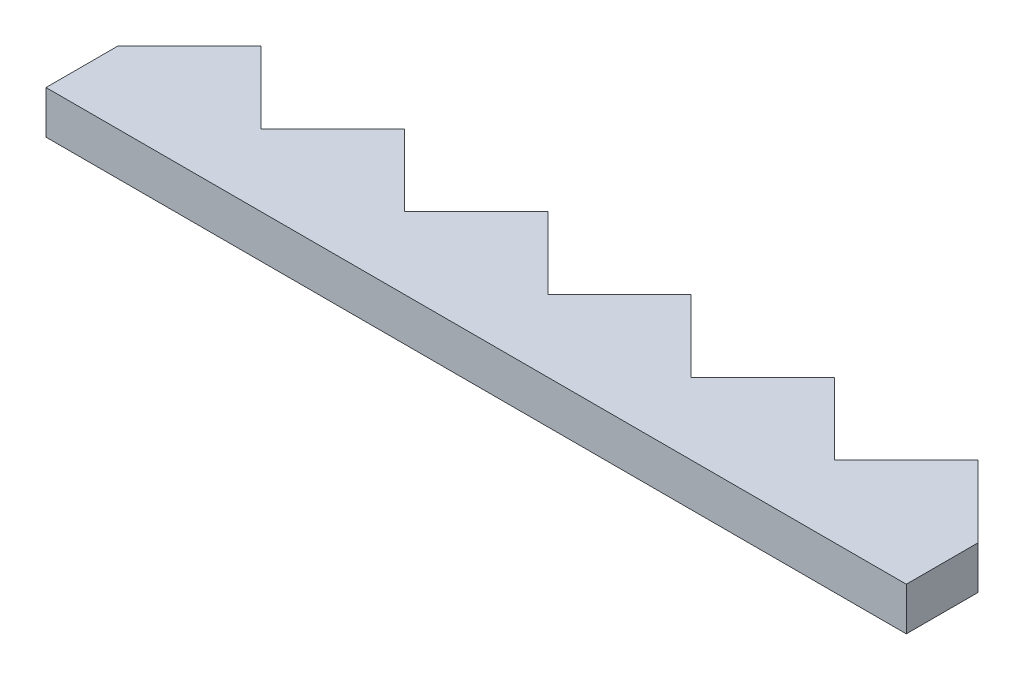
ISO-10303-21;
HEADER;
FILE_DESCRIPTION(('STEP AP214'),'2;1');
FILE_NAME('part.step','',(''),(''),'','','');
FILE_SCHEMA(('AUTOMOTIVE_DESIGN { 1 0 10303 214 1 1 1 1 }'));
ENDSEC;
DATA;
#1=APPLICATION_CONTEXT('core data for automotive mechanical design processes');
#2=APPLICATION_PROTOCOL_DEFINITION('international standard','automotive_design',2000,#1);
#3=PRODUCT_CONTEXT('',#1,'mechanical');
#4=PRODUCT('Part','Part','',(#3));
#5=PRODUCT_RELATED_PRODUCT_CATEGORY('part','',(#4));
#6=PRODUCT_DEFINITION_FORMATION('','',#4);
#7=PRODUCT_DEFINITION_CONTEXT('part definition',#1,'design');
#8=PRODUCT_DEFINITION('design','',#6,#7);
#9=PRODUCT_DEFINITION_SHAPE('','',#8);
#10=(LENGTH_UNIT() NAMED_UNIT(*) SI_UNIT(.MILLI.,.METRE.));
#11=(NAMED_UNIT(*) PLANE_ANGLE_UNIT() SI_UNIT($,.RADIAN.));
#12=(NAMED_UNIT(*) SI_UNIT($,.STERADIAN.) SOLID_ANGLE_UNIT());
#13=UNCERTAINTY_MEASURE_WITH_UNIT(LENGTH_MEASURE(1.E-05),#10,'distance_accuracy_value','');
#14=(GEOMETRIC_REPRESENTATION_CONTEXT(3) GLOBAL_UNCERTAINTY_ASSIGNED_CONTEXT((#13)) GLOBAL_UNIT_ASSIGNED_CONTEXT((#10,
#11,#12)) REPRESENTATION_CONTEXT('',''));
#15=CARTESIAN_POINT('',(0.,0.,0.));
#16=DIRECTION('',(0.,0.,1.));
#17=DIRECTION('',(1.,0.,0.));
#18=AXIS2_PLACEMENT_3D('',#15,#16,#17);
#19=CARTESIAN_POINT('',(0.,3.,-5.));
#20=DIRECTION('',(1.,0.,0.));
#21=DIRECTION('',(0.,0.,-1.));
#22=AXIS2_PLACEMENT_3D('',#19,#20,#21);
#23=PLANE('',#22);
#24=DIRECTION('',(0.,0.,1.));
#25=VECTOR('',#24,1.);
#26=CARTESIAN_POINT('',(0.,0.,-5.));
#27=LINE('',#26,#25);
#28=CARTESIAN_POINT('',(0.,0.,-5.));
#29=VERTEX_POINT('',#28);
#30=CARTESIAN_POINT('',(0.,0.,0.));
#31=VERTEX_POINT('',#30);
#32=EDGE_CURVE('E171',#29,#31,#27,.T.);
#33=ORIENTED_EDGE('',*,*,#32,.T.);
#34=DIRECTION('',(0.,-1.,0.));
#35=VECTOR('',#34,1.);
#36=CARTESIAN_POINT('',(0.,3.,0.));
#37=LINE('',#36,#35);
#38=CARTESIAN_POINT('',(0.,3.,0.));
#39=VERTEX_POINT('',#38);
#40=EDGE_CURVE('E11',#39,#31,#37,.T.);
#41=ORIENTED_EDGE('',*,*,#40,.F.);
#42=DIRECTION('',(0.,0.,1.));
#43=VECTOR('',#42,1.);
#44=CARTESIAN_POINT('',(0.,3.,-5.));
#45=LINE('',#44,#43);
#46=CARTESIAN_POINT('',(0.,3.,-5.));
#47=VERTEX_POINT('',#46);
#48=EDGE_CURVE('E199',#47,#39,#45,.T.);
#49=ORIENTED_EDGE('',*,*,#48,.F.);
#50=DIRECTION('',(0.,-1.,0.));
#51=VECTOR('',#50,1.);
#52=CARTESIAN_POINT('',(0.,3.,-5.));
#53=LINE('',#52,#51);
#54=EDGE_CURVE('E167',#47,#29,#53,.T.);
#55=ORIENTED_EDGE('',*,*,#54,.T.);
#56=EDGE_LOOP('',(#33,#41,#49,#55));
#57=FACE_BOUND('',#56,.T.);
#58=ADVANCED_FACE('F33',(#57),#23,.F.);
#59=CARTESIAN_POINT('',(0.,3.,0.));
#60=DIRECTION('',(0.,0.,-1.));
#61=DIRECTION('',(-1.,0.,0.));
#62=AXIS2_PLACEMENT_3D('',#59,#60,#61);
#63=PLANE('',#62);
#64=DIRECTION('',(1.,0.,0.));
#65=VECTOR('',#64,1.);
#66=CARTESIAN_POINT('',(0.,0.,0.));
#67=LINE('',#66,#65);
#68=CARTESIAN_POINT('',(60.,0.,0.));
#69=VERTEX_POINT('',#68);
#70=EDGE_CURVE('E174',#31,#69,#67,.T.);
#71=ORIENTED_EDGE('',*,*,#70,.T.);
#72=DIRECTION('',(0.,-1.,0.));
#73=VECTOR('',#72,1.);
#74=CARTESIAN_POINT('',(60.,3.,0.));
#75=LINE('',#74,#73);
#76=CARTESIAN_POINT('',(60.,3.,0.));
#77=VERTEX_POINT('',#76);
#78=EDGE_CURVE('E41',#77,#69,#75,.T.);
#79=ORIENTED_EDGE('',*,*,#78,.F.);
#80=DIRECTION('',(1.,0.,0.));
#81=VECTOR('',#80,1.);
#82=CARTESIAN_POINT('',(0.,3.,0.));
#83=LINE('',#82,#81);
#84=EDGE_CURVE('E113',#39,#77,#83,.T.);
#85=ORIENTED_EDGE('',*,*,#84,.F.);
#86=ORIENTED_EDGE('',*,*,#40,.T.);
#87=EDGE_LOOP('',(#71,#79,#85,#86));
#88=FACE_BOUND('',#87,.T.);
#89=ADVANCED_FACE('F292',(#88),#63,.F.);
#90=CARTESIAN_POINT('',(60.,3.,0.));
#91=DIRECTION('',(-1.,0.,0.));
#92=DIRECTION('',(0.,0.,1.));
#93=AXIS2_PLACEMENT_3D('',#90,#91,#92);
#94=PLANE('',#93);
#95=DIRECTION('',(0.,0.,-1.));
#96=VECTOR('',#95,1.);
#97=CARTESIAN_POINT('',(60.,0.,0.));
#98=LINE('',#97,#96);
#99=CARTESIAN_POINT('',(60.,0.,-5.));
#100=VERTEX_POINT('',#99);
#101=EDGE_CURVE('E176',#69,#100,#98,.T.);
#102=ORIENTED_EDGE('',*,*,#101,.T.);
#103=DIRECTION('',(0.,-1.,0.));
#104=VECTOR('',#103,1.);
#105=CARTESIAN_POINT('',(60.,3.,-5.));
#106=LINE('',#105,#104);
#107=CARTESIAN_POINT('',(60.,3.,-5.));
#108=VERTEX_POINT('',#107);
#109=EDGE_CURVE('E227',#108,#100,#106,.T.);
#110=ORIENTED_EDGE('',*,*,#109,.F.);
#111=DIRECTION('',(0.,0.,-1.));
#112=VECTOR('',#111,1.);
#113=CARTESIAN_POINT('',(60.,3.,0.));
#114=LINE('',#113,#112);
#115=EDGE_CURVE('E235',#77,#108,#114,.T.);
#116=ORIENTED_EDGE('',*,*,#115,.F.);
#117=ORIENTED_EDGE('',*,*,#78,.T.);
#118=EDGE_LOOP('',(#102,#110,#116,#117));
#119=FACE_BOUND('',#118,.T.);
#120=ADVANCED_FACE('F233',(#119),#94,.F.);
#121=CARTESIAN_POINT('',(55.,3.,-10.));
#122=DIRECTION('',(-0.707106781186547,0.,0.707106781186548));
#123=DIRECTION('',(0.707106781186548,0.,0.707106781186547));
#124=AXIS2_PLACEMENT_3D('',#121,#122,#123);
#125=PLANE('',#124);
#126=DIRECTION('',(-0.707106781186548,0.,-0.707106781186547));
#127=VECTOR('',#126,1.);
#128=CARTESIAN_POINT('',(55.,0.,-10.));
#129=LINE('',#128,#127);
#130=CARTESIAN_POINT('',(55.,0.,-10.));
#131=VERTEX_POINT('',#130);
#132=EDGE_CURVE('E178',#100,#131,#129,.T.);
#133=ORIENTED_EDGE('',*,*,#132,.T.);
#134=DIRECTION('',(0.,-1.,0.));
#135=VECTOR('',#134,1.);
#136=CARTESIAN_POINT('',(55.,3.,-10.));
#137=LINE('',#136,#135);
#138=CARTESIAN_POINT('',(55.,3.,-10.));
#139=VERTEX_POINT('',#138);
#140=EDGE_CURVE('E224',#139,#131,#137,.T.);
#141=ORIENTED_EDGE('',*,*,#140,.F.);
#142=DIRECTION('',(-0.707106781186548,0.,-0.707106781186547));
#143=VECTOR('',#142,1.);
#144=CARTESIAN_POINT('',(55.,3.,-10.));
#145=LINE('',#144,#143);
#146=EDGE_CURVE('E253',#108,#139,#145,.T.);
#147=ORIENTED_EDGE('',*,*,#146,.F.);
#148=ORIENTED_EDGE('',*,*,#109,.T.);
#149=EDGE_LOOP('',(#133,#141,#147,#148));
#150=FACE_BOUND('',#149,.T.);
#151=ADVANCED_FACE('F244',(#150),#125,.F.);
#152=CARTESIAN_POINT('',(50.,3.,-5.));
#153=DIRECTION('',(0.707106781186548,0.,0.707106781186547));
#154=DIRECTION('',(0.707106781186547,0.,-0.707106781186548));
#155=AXIS2_PLACEMENT_3D('',#152,#153,#154);
#156=PLANE('',#155);
#157=DIRECTION('',(-0.707106781186547,0.,0.707106781186548));
#158=VECTOR('',#157,1.);
#159=CARTESIAN_POINT('',(50.,0.,-5.));
#160=LINE('',#159,#158);
#161=CARTESIAN_POINT('',(50.,0.,-5.));
#162=VERTEX_POINT('',#161);
#163=EDGE_CURVE('E180',#131,#162,#160,.T.);
#164=ORIENTED_EDGE('',*,*,#163,.T.);
#165=DIRECTION('',(0.,-1.,0.));
#166=VECTOR('',#165,1.);
#167=CARTESIAN_POINT('',(50.,3.,-5.));
#168=LINE('',#167,#166);
#169=CARTESIAN_POINT('',(50.,3.,-5.));
#170=VERTEX_POINT('',#169);
#171=EDGE_CURVE('E221',#170,#162,#168,.T.);
#172=ORIENTED_EDGE('',*,*,#171,.F.);
#173=DIRECTION('',(-0.707106781186547,0.,0.707106781186548));
#174=VECTOR('',#173,1.);
#175=CARTESIAN_POINT('',(50.,3.,-5.));
#176=LINE('',#175,#174);
#177=EDGE_CURVE('E250',#139,#170,#176,.T.);
#178=ORIENTED_EDGE('',*,*,#177,.F.);
#179=ORIENTED_EDGE('',*,*,#140,.T.);
#180=EDGE_LOOP('',(#164,#172,#178,#179));
#181=FACE_BOUND('',#180,.T.);
#182=ADVANCED_FACE('F248',(#181),#156,.F.);
#183=CARTESIAN_POINT('',(45.,3.,-10.));
#184=DIRECTION('',(-0.707106781186548,0.,0.707106781186547));
#185=DIRECTION('',(0.707106781186547,0.,0.707106781186548));
#186=AXIS2_PLACEMENT_3D('',#183,#184,#185);
#187=PLANE('',#186);
#188=DIRECTION('',(-0.707106781186547,0.,-0.707106781186548));
#189=VECTOR('',#188,1.);
#190=CARTESIAN_POINT('',(45.,0.,-10.));
#191=LINE('',#190,#189);
#192=CARTESIAN_POINT('',(45.,0.,-10.));
#193=VERTEX_POINT('',#192);
#194=EDGE_CURVE('E182',#162,#193,#191,.T.);
#195=ORIENTED_EDGE('',*,*,#194,.T.);
#196=DIRECTION('',(0.,-1.,0.));
#197=VECTOR('',#196,1.);
#198=CARTESIAN_POINT('',(45.,3.,-10.));
#199=LINE('',#198,#197);
#200=CARTESIAN_POINT('',(45.,3.,-10.));
#201=VERTEX_POINT('',#200);
#202=EDGE_CURVE('E218',#201,#193,#199,.T.);
#203=ORIENTED_EDGE('',*,*,#202,.F.);
#204=DIRECTION('',(-0.707106781186547,0.,-0.707106781186548));
#205=VECTOR('',#204,1.);
#206=CARTESIAN_POINT('',(45.,3.,-10.));
#207=LINE('',#206,#205);
#208=EDGE_CURVE('E252',#170,#201,#207,.T.);
#209=ORIENTED_EDGE('',*,*,#208,.F.);
#210=ORIENTED_EDGE('',*,*,#171,.T.);
#211=EDGE_LOOP('',(#195,#203,#209,#210));
#212=FACE_BOUND('',#211,.T.);
#213=ADVANCED_FACE('F305',(#212),#187,.F.);
#214=CARTESIAN_POINT('',(40.,3.,-5.));
#215=DIRECTION('',(0.707106781186548,0.,0.707106781186547));
#216=DIRECTION('',(0.707106781186547,0.,-0.707106781186548));
#217=AXIS2_PLACEMENT_3D('',#214,#215,#216);
#218=PLANE('',#217);
#219=DIRECTION('',(-0.707106781186547,0.,0.707106781186548));
#220=VECTOR('',#219,1.);
#221=CARTESIAN_POINT('',(40.,0.,-5.));
#222=LINE('',#221,#220);
#223=CARTESIAN_POINT('',(40.,0.,-5.));
#224=VERTEX_POINT('',#223);
#225=EDGE_CURVE('E184',#193,#224,#222,.T.);
#226=ORIENTED_EDGE('',*,*,#225,.T.);
#227=DIRECTION('',(0.,-1.,0.));
#228=VECTOR('',#227,1.);
#229=CARTESIAN_POINT('',(40.,3.,-5.));
#230=LINE('',#229,#228);
#231=CARTESIAN_POINT('',(40.,3.,-5.));
#232=VERTEX_POINT('',#231);
#233=EDGE_CURVE('E215',#232,#224,#230,.T.);
#234=ORIENTED_EDGE('',*,*,#233,.F.);
#235=DIRECTION('',(-0.707106781186547,0.,0.707106781186548));
#236=VECTOR('',#235,1.);
#237=CARTESIAN_POINT('',(40.,3.,-5.));
#238=LINE('',#237,#236);
#239=EDGE_CURVE('E255',#201,#232,#238,.T.);
#240=ORIENTED_EDGE('',*,*,#239,.F.);
#241=ORIENTED_EDGE('',*,*,#202,.T.);
#242=EDGE_LOOP('',(#226,#234,#240,#241));
#243=FACE_BOUND('',#242,.T.);
#244=ADVANCED_FACE('F308',(#243),#218,.F.);
#245=CARTESIAN_POINT('',(35.,3.,-10.));
#246=DIRECTION('',(-0.707106781186547,0.,0.707106781186548));
#247=DIRECTION('',(0.707106781186548,0.,0.707106781186547));
#248=AXIS2_PLACEMENT_3D('',#245,#246,#247);
#249=PLANE('',#248);
#250=DIRECTION('',(-0.707106781186548,0.,-0.707106781186547));
#251=VECTOR('',#250,1.);
#252=CARTESIAN_POINT('',(35.,0.,-10.));
#253=LINE('',#252,#251);
#254=CARTESIAN_POINT('',(35.,0.,-10.));
#255=VERTEX_POINT('',#254);
#256=EDGE_CURVE('E186',#224,#255,#253,.T.);
#257=ORIENTED_EDGE('',*,*,#256,.T.);
#258=DIRECTION('',(0.,-1.,0.));
#259=VECTOR('',#258,1.);
#260=CARTESIAN_POINT('',(35.,3.,-10.));
#261=LINE('',#260,#259);
#262=CARTESIAN_POINT('',(35.,3.,-10.));
#263=VERTEX_POINT('',#262);
#264=EDGE_CURVE('E212',#263,#255,#261,.T.);
#265=ORIENTED_EDGE('',*,*,#264,.F.);
#266=DIRECTION('',(-0.707106781186548,0.,-0.707106781186547));
#267=VECTOR('',#266,1.);
#268=CARTESIAN_POINT('',(35.,3.,-10.));
#269=LINE('',#268,#267);
#270=EDGE_CURVE('E261',#232,#263,#269,.T.);
#271=ORIENTED_EDGE('',*,*,#270,.F.);
#272=ORIENTED_EDGE('',*,*,#233,.T.);
#273=EDGE_LOOP('',(#257,#265,#271,#272));
#274=FACE_BOUND('',#273,.T.);
#275=ADVANCED_FACE('F312',(#274),#249,.F.);
#276=CARTESIAN_POINT('',(30.,3.,-5.));
#277=DIRECTION('',(0.707106781186548,0.,0.707106781186547));
#278=DIRECTION('',(0.707106781186547,0.,-0.707106781186548));
#279=AXIS2_PLACEMENT_3D('',#276,#277,#278);
#280=PLANE('',#279);
#281=DIRECTION('',(-0.707106781186547,0.,0.707106781186548));
#282=VECTOR('',#281,1.);
#283=CARTESIAN_POINT('',(30.,0.,-5.));
#284=LINE('',#283,#282);
#285=CARTESIAN_POINT('',(30.,0.,-5.));
#286=VERTEX_POINT('',#285);
#287=EDGE_CURVE('E188',#255,#286,#284,.T.);
#288=ORIENTED_EDGE('',*,*,#287,.T.);
#289=DIRECTION('',(0.,-1.,0.));
#290=VECTOR('',#289,1.);
#291=CARTESIAN_POINT('',(30.,3.,-5.));
#292=LINE('',#291,#290);
#293=CARTESIAN_POINT('',(30.,3.,-5.));
#294=VERTEX_POINT('',#293);
#295=EDGE_CURVE('E209',#294,#286,#292,.T.);
#296=ORIENTED_EDGE('',*,*,#295,.F.);
#297=DIRECTION('',(-0.707106781186547,0.,0.707106781186548));
#298=VECTOR('',#297,1.);
#299=CARTESIAN_POINT('',(30.,3.,-5.));
#300=LINE('',#299,#298);
#301=EDGE_CURVE('E263',#263,#294,#300,.T.);
#302=ORIENTED_EDGE('',*,*,#301,.F.);
#303=ORIENTED_EDGE('',*,*,#264,.T.);
#304=EDGE_LOOP('',(#288,#296,#302,#303));
#305=FACE_BOUND('',#304,.T.);
#306=ADVANCED_FACE('F316',(#305),#280,.F.);
#307=CARTESIAN_POINT('',(25.,3.,-10.));
#308=DIRECTION('',(-0.707106781186548,0.,0.707106781186547));
#309=DIRECTION('',(0.707106781186547,0.,0.707106781186548));
#310=AXIS2_PLACEMENT_3D('',#307,#308,#309);
#311=PLANE('',#310);
#312=DIRECTION('',(-0.707106781186547,0.,-0.707106781186548));
#313=VECTOR('',#312,1.);
#314=CARTESIAN_POINT('',(25.,0.,-10.));
#315=LINE('',#314,#313);
#316=CARTESIAN_POINT('',(25.,0.,-10.));
#317=VERTEX_POINT('',#316);
#318=EDGE_CURVE('E190',#286,#317,#315,.T.);
#319=ORIENTED_EDGE('',*,*,#318,.T.);
#320=DIRECTION('',(0.,-1.,0.));
#321=VECTOR('',#320,1.);
#322=CARTESIAN_POINT('',(25.,3.,-10.));
#323=LINE('',#322,#321);
#324=CARTESIAN_POINT('',(25.,3.,-10.));
#325=VERTEX_POINT('',#324);
#326=EDGE_CURVE('E206',#325,#317,#323,.T.);
#327=ORIENTED_EDGE('',*,*,#326,.F.);
#328=DIRECTION('',(-0.707106781186547,0.,-0.707106781186548));
#329=VECTOR('',#328,1.);
#330=CARTESIAN_POINT('',(25.,3.,-10.));
#331=LINE('',#330,#329);
#332=EDGE_CURVE('E265',#294,#325,#331,.T.);
#333=ORIENTED_EDGE('',*,*,#332,.F.);
#334=ORIENTED_EDGE('',*,*,#295,.T.);
#335=EDGE_LOOP('',(#319,#327,#333,#334));
#336=FACE_BOUND('',#335,.T.);
#337=ADVANCED_FACE('F320',(#336),#311,.F.);
#338=CARTESIAN_POINT('',(20.,3.,-5.));
#339=DIRECTION('',(0.707106781186547,0.,0.707106781186548));
#340=DIRECTION('',(0.707106781186548,0.,-0.707106781186547));
#341=AXIS2_PLACEMENT_3D('',#338,#339,#340);
#342=PLANE('',#341);
#343=DIRECTION('',(-0.707106781186548,0.,0.707106781186547));
#344=VECTOR('',#343,1.);
#345=CARTESIAN_POINT('',(20.,0.,-5.));
#346=LINE('',#345,#344);
#347=CARTESIAN_POINT('',(20.,0.,-5.));
#348=VERTEX_POINT('',#347);
#349=EDGE_CURVE('E192',#317,#348,#346,.T.);
#350=ORIENTED_EDGE('',*,*,#349,.T.);
#351=DIRECTION('',(0.,-1.,0.));
#352=VECTOR('',#351,1.);
#353=CARTESIAN_POINT('',(20.,3.,-5.));
#354=LINE('',#353,#352);
#355=CARTESIAN_POINT('',(20.,3.,-5.));
#356=VERTEX_POINT('',#355);
#357=EDGE_CURVE('E203',#356,#348,#354,.T.);
#358=ORIENTED_EDGE('',*,*,#357,.F.);
#359=DIRECTION('',(-0.707106781186548,0.,0.707106781186547));
#360=VECTOR('',#359,1.);
#361=CARTESIAN_POINT('',(20.,3.,-5.));
#362=LINE('',#361,#360);
#363=EDGE_CURVE('E267',#325,#356,#362,.T.);
#364=ORIENTED_EDGE('',*,*,#363,.F.);
#365=ORIENTED_EDGE('',*,*,#326,.T.);
#366=EDGE_LOOP('',(#350,#358,#364,#365));
#367=FACE_BOUND('',#366,.T.);
#368=ADVANCED_FACE('F273',(#367),#342,.F.);
#369=CARTESIAN_POINT('',(15.,3.,-10.));
#370=DIRECTION('',(-0.707106781186547,0.,0.707106781186548));
#371=DIRECTION('',(0.707106781186548,0.,0.707106781186547));
#372=AXIS2_PLACEMENT_3D('',#369,#370,#371);
#373=PLANE('',#372);
#374=DIRECTION('',(-0.707106781186548,0.,-0.707106781186547));
#375=VECTOR('',#374,1.);
#376=CARTESIAN_POINT('',(15.,0.,-10.));
#377=LINE('',#376,#375);
#378=CARTESIAN_POINT('',(15.,0.,-10.));
#379=VERTEX_POINT('',#378);
#380=EDGE_CURVE('E194',#348,#379,#377,.T.);
#381=ORIENTED_EDGE('',*,*,#380,.T.);
#382=DIRECTION('',(0.,-1.,0.));
#383=VECTOR('',#382,1.);
#384=CARTESIAN_POINT('',(15.,3.,-10.));
#385=LINE('',#384,#383);
#386=CARTESIAN_POINT('',(15.,3.,-10.));
#387=VERTEX_POINT('',#386);
#388=EDGE_CURVE('E162',#387,#379,#385,.T.);
#389=ORIENTED_EDGE('',*,*,#388,.F.);
#390=DIRECTION('',(-0.707106781186548,0.,-0.707106781186547));
#391=VECTOR('',#390,1.);
#392=CARTESIAN_POINT('',(15.,3.,-10.));
#393=LINE('',#392,#391);
#394=EDGE_CURVE('E153',#356,#387,#393,.T.);
#395=ORIENTED_EDGE('',*,*,#394,.F.);
#396=ORIENTED_EDGE('',*,*,#357,.T.);
#397=EDGE_LOOP('',(#381,#389,#395,#396));
#398=FACE_BOUND('',#397,.T.);
#399=ADVANCED_FACE('F277',(#398),#373,.F.);
#400=CARTESIAN_POINT('',(10.,3.,-5.));
#401=DIRECTION('',(0.707106781186547,0.,0.707106781186547));
#402=DIRECTION('',(0.707106781186548,0.,-0.707106781186548));
#403=AXIS2_PLACEMENT_3D('',#400,#401,#402);
#404=PLANE('',#403);
#405=DIRECTION('',(-0.707106781186548,0.,0.707106781186548));
#406=VECTOR('',#405,1.);
#407=CARTESIAN_POINT('',(10.,0.,-5.));
#408=LINE('',#407,#406);
#409=CARTESIAN_POINT('',(10.,0.,-5.));
#410=VERTEX_POINT('',#409);
#411=EDGE_CURVE('E161',#379,#410,#408,.T.);
#412=ORIENTED_EDGE('',*,*,#411,.T.);
#413=DIRECTION('',(0.,-1.,0.));
#414=VECTOR('',#413,1.);
#415=CARTESIAN_POINT('',(10.,3.,-5.));
#416=LINE('',#415,#414);
#417=CARTESIAN_POINT('',(10.,3.,-5.));
#418=VERTEX_POINT('',#417);
#419=EDGE_CURVE('E158',#418,#410,#416,.T.);
#420=ORIENTED_EDGE('',*,*,#419,.F.);
#421=DIRECTION('',(-0.707106781186548,0.,0.707106781186548));
#422=VECTOR('',#421,1.);
#423=CARTESIAN_POINT('',(10.,3.,-5.));
#424=LINE('',#423,#422);
#425=EDGE_CURVE('E147',#387,#418,#424,.T.);
#426=ORIENTED_EDGE('',*,*,#425,.F.);
#427=ORIENTED_EDGE('',*,*,#388,.T.);
#428=EDGE_LOOP('',(#412,#420,#426,#427));
#429=FACE_BOUND('',#428,.T.);
#430=ADVANCED_FACE('F159',(#429),#404,.F.);
#431=CARTESIAN_POINT('',(5.,3.,-10.));
#432=DIRECTION('',(-0.707106781186547,0.,0.707106781186548));
#433=DIRECTION('',(0.707106781186548,0.,0.707106781186547));
#434=AXIS2_PLACEMENT_3D('',#431,#432,#433);
#435=PLANE('',#434);
#436=DIRECTION('',(-0.707106781186548,0.,-0.707106781186547));
#437=VECTOR('',#436,1.);
#438=CARTESIAN_POINT('',(5.,0.,-10.));
#439=LINE('',#438,#437);
#440=CARTESIAN_POINT('',(5.,0.,-10.));
#441=VERTEX_POINT('',#440);
#442=EDGE_CURVE('E99',#410,#441,#439,.T.);
#443=ORIENTED_EDGE('',*,*,#442,.T.);
#444=DIRECTION('',(0.,-1.,0.));
#445=VECTOR('',#444,1.);
#446=CARTESIAN_POINT('',(5.,3.,-10.));
#447=LINE('',#446,#445);
#448=CARTESIAN_POINT('',(5.,3.,-10.));
#449=VERTEX_POINT('',#448);
#450=EDGE_CURVE('E163',#449,#441,#447,.T.);
#451=ORIENTED_EDGE('',*,*,#450,.F.);
#452=DIRECTION('',(-0.707106781186548,0.,-0.707106781186547));
#453=VECTOR('',#452,1.);
#454=CARTESIAN_POINT('',(5.,3.,-10.));
#455=LINE('',#454,#453);
#456=EDGE_CURVE('E151',#418,#449,#455,.T.);
#457=ORIENTED_EDGE('',*,*,#456,.F.);
#458=ORIENTED_EDGE('',*,*,#419,.T.);
#459=EDGE_LOOP('',(#443,#451,#457,#458));
#460=FACE_BOUND('',#459,.T.);
#461=ADVANCED_FACE('F165',(#460),#435,.F.);
#462=CARTESIAN_POINT('',(0.,3.,-5.));
#463=DIRECTION('',(0.707106781186548,0.,0.707106781186547));
#464=DIRECTION('',(0.707106781186547,0.,-0.707106781186548));
#465=AXIS2_PLACEMENT_3D('',#462,#463,#464);
#466=PLANE('',#465);
#467=DIRECTION('',(-0.707106781186547,0.,0.707106781186548));
#468=VECTOR('',#467,1.);
#469=CARTESIAN_POINT('',(0.,0.,-5.));
#470=LINE('',#469,#468);
#471=EDGE_CURVE('E105',#441,#29,#470,.T.);
#472=ORIENTED_EDGE('',*,*,#471,.T.);
#473=ORIENTED_EDGE('',*,*,#54,.F.);
#474=DIRECTION('',(-0.707106781186547,0.,0.707106781186548));
#475=VECTOR('',#474,1.);
#476=CARTESIAN_POINT('',(0.,3.,-5.));
#477=LINE('',#476,#475);
#478=EDGE_CURVE('E49',#449,#47,#477,.T.);
#479=ORIENTED_EDGE('',*,*,#478,.F.);
#480=ORIENTED_EDGE('',*,*,#450,.T.);
#481=EDGE_LOOP('',(#472,#473,#479,#480));
#482=FACE_BOUND('',#481,.T.);
#483=ADVANCED_FACE('F281',(#482),#466,.F.);
#484=CARTESIAN_POINT('',(0.,3.,0.));
#485=DIRECTION('',(0.,1.,0.));
#486=DIRECTION('',(0.,0.,1.));
#487=AXIS2_PLACEMENT_3D('',#484,#485,#486);
#488=PLANE('',#487);
#489=ORIENTED_EDGE('',*,*,#48,.T.);
#490=ORIENTED_EDGE('',*,*,#84,.T.);
#491=ORIENTED_EDGE('',*,*,#115,.T.);
#492=ORIENTED_EDGE('',*,*,#146,.T.);
#493=ORIENTED_EDGE('',*,*,#177,.T.);
#494=ORIENTED_EDGE('',*,*,#208,.T.);
#495=ORIENTED_EDGE('',*,*,#239,.T.);
#496=ORIENTED_EDGE('',*,*,#270,.T.);
#497=ORIENTED_EDGE('',*,*,#301,.T.);
#498=ORIENTED_EDGE('',*,*,#332,.T.);
#499=ORIENTED_EDGE('',*,*,#363,.T.);
#500=ORIENTED_EDGE('',*,*,#394,.T.);
#501=ORIENTED_EDGE('',*,*,#425,.T.);
#502=ORIENTED_EDGE('',*,*,#456,.T.);
#503=ORIENTED_EDGE('',*,*,#478,.T.);
#504=EDGE_LOOP('',(#489,#490,#491,#492,#493,#494,#495,#496,#497,#498,#499,#500,#501,#502,#503));
#505=FACE_BOUND('',#504,.T.);
#506=ADVANCED_FACE('F149',(#505),#488,.T.);
#507=CARTESIAN_POINT('',(0.,0.,0.));
#508=DIRECTION('',(0.,1.,0.));
#509=DIRECTION('',(0.,0.,1.));
#510=AXIS2_PLACEMENT_3D('',#507,#508,#509);
#511=PLANE('',#510);
#512=ORIENTED_EDGE('',*,*,#32,.F.);
#513=ORIENTED_EDGE('',*,*,#471,.F.);
#514=ORIENTED_EDGE('',*,*,#442,.F.);
#515=ORIENTED_EDGE('',*,*,#411,.F.);
#516=ORIENTED_EDGE('',*,*,#380,.F.);
#517=ORIENTED_EDGE('',*,*,#349,.F.);
#518=ORIENTED_EDGE('',*,*,#318,.F.);
#519=ORIENTED_EDGE('',*,*,#287,.F.);
#520=ORIENTED_EDGE('',*,*,#256,.F.);
#521=ORIENTED_EDGE('',*,*,#225,.F.);
#522=ORIENTED_EDGE('',*,*,#194,.F.);
#523=ORIENTED_EDGE('',*,*,#163,.F.);
#524=ORIENTED_EDGE('',*,*,#132,.F.);
#525=ORIENTED_EDGE('',*,*,#101,.F.);
#526=ORIENTED_EDGE('',*,*,#70,.F.);
#527=EDGE_LOOP('',(#512,#513,#514,#515,#516,#517,#518,#519,#520,#521,#522,#523,#524,#525,#526));
#528=FACE_BOUND('',#527,.T.);
#529=ADVANCED_FACE('F239',(#528),#511,.F.);
#530=CLOSED_SHELL('',(#58,#89,#120,#151,#182,#213,#244,#275,#306,#337,#368,#399,#430,#461,#483,
#506,#529));
#531=MANIFOLD_SOLID_BREP('B2',#530);
#532=ADVANCED_BREP_SHAPE_REPRESENTATION('',(#18,#531),#14);
#533=SHAPE_DEFINITION_REPRESENTATION(#9,#532);
ENDSEC;
END-ISO-10303-21;
